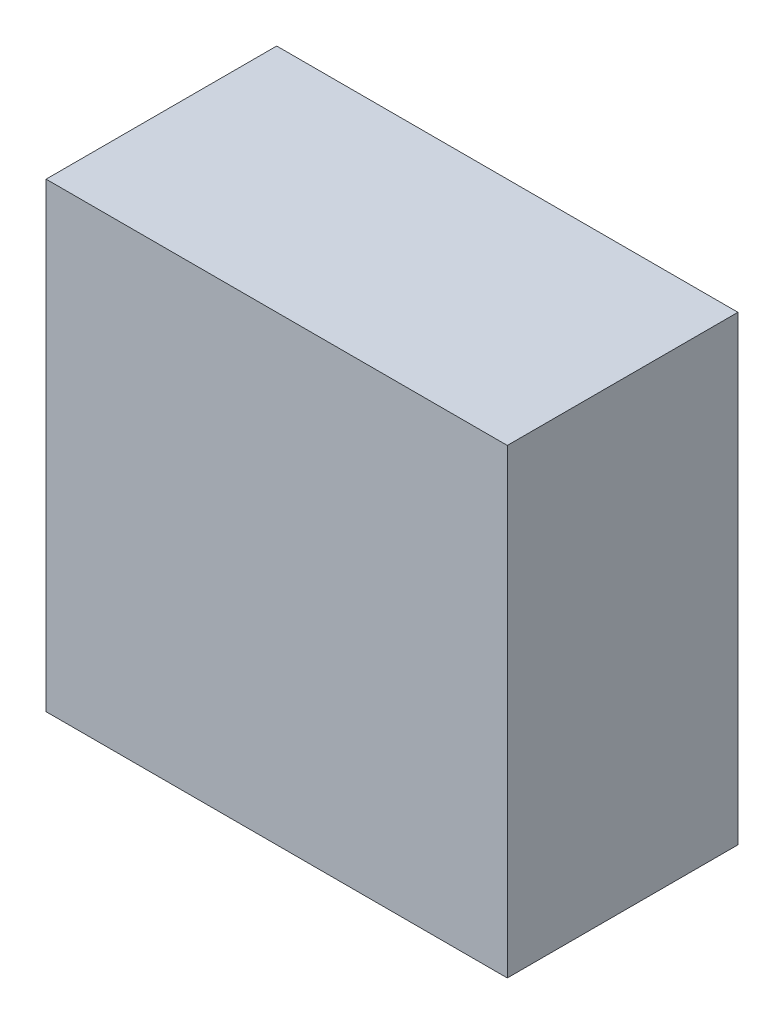
ISO-10303-21;
HEADER;
FILE_DESCRIPTION(('STEP AP214'),'2;1');
FILE_NAME('part.step','',(''),(''),'','','');
FILE_SCHEMA(('AUTOMOTIVE_DESIGN { 1 0 10303 214 1 1 1 1 }'));
ENDSEC;
DATA;
#1=APPLICATION_CONTEXT('core data for automotive mechanical design processes');
#2=APPLICATION_PROTOCOL_DEFINITION('international standard','automotive_design',2000,#1);
#3=PRODUCT_CONTEXT('',#1,'mechanical');
#4=PRODUCT('Part','Part','',(#3));
#5=PRODUCT_RELATED_PRODUCT_CATEGORY('part','',(#4));
#6=PRODUCT_DEFINITION_FORMATION('','',#4);
#7=PRODUCT_DEFINITION_CONTEXT('part definition',#1,'design');
#8=PRODUCT_DEFINITION('design','',#6,#7);
#9=PRODUCT_DEFINITION_SHAPE('','',#8);
#10=(LENGTH_UNIT() NAMED_UNIT(*) SI_UNIT(.MILLI.,.METRE.));
#11=(NAMED_UNIT(*) PLANE_ANGLE_UNIT() SI_UNIT($,.RADIAN.));
#12=(NAMED_UNIT(*) SI_UNIT($,.STERADIAN.) SOLID_ANGLE_UNIT());
#13=UNCERTAINTY_MEASURE_WITH_UNIT(LENGTH_MEASURE(1.E-05),#10,'distance_accuracy_value','');
#14=(GEOMETRIC_REPRESENTATION_CONTEXT(3) GLOBAL_UNCERTAINTY_ASSIGNED_CONTEXT((#13)) GLOBAL_UNIT_ASSIGNED_CONTEXT((#10,
#11,#12)) REPRESENTATION_CONTEXT('',''));
#15=CARTESIAN_POINT('',(0.,0.,0.));
#16=DIRECTION('',(0.,0.,1.));
#17=DIRECTION('',(1.,0.,0.));
#18=AXIS2_PLACEMENT_3D('',#15,#16,#17);
#19=CARTESIAN_POINT('',(0.,0.,2.75));
#20=DIRECTION('',(0.,0.,-1.));
#21=DIRECTION('',(-1.,0.,0.));
#22=AXIS2_PLACEMENT_3D('',#19,#20,#21);
#23=PLANE('',#22);
#24=DIRECTION('',(1.,0.,0.));
#25=VECTOR('',#24,1.);
#26=CARTESIAN_POINT('',(158.313158045851,-107.070884155696,2.75));
#27=LINE('',#26,#25);
#28=CARTESIAN_POINT('',(158.313158045851,-107.070884155696,2.75));
#29=VERTEX_POINT('',#28);
#30=CARTESIAN_POINT('',(154.313158045851,-107.070884155696,2.75));
#31=VERTEX_POINT('',#30);
#32=EDGE_CURVE('E80',#29,#31,#27,.F.);
#33=ORIENTED_EDGE('',*,*,#32,.T.);
#34=DIRECTION('',(0.,1.,0.));
#35=VECTOR('',#34,1.);
#36=CARTESIAN_POINT('',(154.313158045851,-107.070884155696,2.75));
#37=LINE('',#36,#35);
#38=CARTESIAN_POINT('',(154.313158045851,-111.070884155696,2.75));
#39=VERTEX_POINT('',#38);
#40=EDGE_CURVE('E55',#31,#39,#37,.F.);
#41=ORIENTED_EDGE('',*,*,#40,.T.);
#42=DIRECTION('',(1.,0.,0.));
#43=VECTOR('',#42,1.);
#44=CARTESIAN_POINT('',(158.313158045851,-111.070884155696,2.75));
#45=LINE('',#44,#43);
#46=CARTESIAN_POINT('',(158.313158045851,-111.070884155696,2.75));
#47=VERTEX_POINT('',#46);
#48=EDGE_CURVE('E57',#39,#47,#45,.T.);
#49=ORIENTED_EDGE('',*,*,#48,.T.);
#50=DIRECTION('',(0.,1.,0.));
#51=VECTOR('',#50,1.);
#52=CARTESIAN_POINT('',(158.313158045851,-107.070884155696,2.75));
#53=LINE('',#52,#51);
#54=EDGE_CURVE('E20',#47,#29,#53,.T.);
#55=ORIENTED_EDGE('',*,*,#54,.T.);
#56=EDGE_LOOP('',(#33,#41,#49,#55));
#57=FACE_BOUND('',#56,.T.);
#58=ADVANCED_FACE('F17',(#57),#23,.F.);
#59=CARTESIAN_POINT('',(158.313158045851,-107.070884155696,2.75));
#60=DIRECTION('',(-1.,0.,0.));
#61=DIRECTION('',(0.,0.,1.));
#62=AXIS2_PLACEMENT_3D('',#59,#60,#61);
#63=PLANE('',#62);
#64=DIRECTION('',(0.,0.,-1.));
#65=VECTOR('',#64,1.);
#66=CARTESIAN_POINT('',(158.313158045851,-107.070884155696,2.75));
#67=LINE('',#66,#65);
#68=CARTESIAN_POINT('',(158.313158045851,-107.070884155696,0.75));
#69=VERTEX_POINT('',#68);
#70=EDGE_CURVE('E68',#69,#29,#67,.F.);
#71=ORIENTED_EDGE('',*,*,#70,.T.);
#72=ORIENTED_EDGE('',*,*,#54,.F.);
#73=DIRECTION('',(0.,0.,1.));
#74=VECTOR('',#73,1.);
#75=CARTESIAN_POINT('',(158.313158045851,-111.070884155696,2.75));
#76=LINE('',#75,#74);
#77=CARTESIAN_POINT('',(158.313158045851,-111.070884155696,0.75));
#78=VERTEX_POINT('',#77);
#79=EDGE_CURVE('E63',#47,#78,#76,.F.);
#80=ORIENTED_EDGE('',*,*,#79,.T.);
#81=DIRECTION('',(0.,1.,0.));
#82=VECTOR('',#81,1.);
#83=CARTESIAN_POINT('',(158.313158045851,0.,0.75));
#84=LINE('',#83,#82);
#85=EDGE_CURVE('E83',#69,#78,#84,.F.);
#86=ORIENTED_EDGE('',*,*,#85,.F.);
#87=EDGE_LOOP('',(#71,#72,#80,#86));
#88=FACE_BOUND('',#87,.T.);
#89=ADVANCED_FACE('F65',(#88),#63,.F.);
#90=CARTESIAN_POINT('',(158.313158045851,-111.070884155696,2.75));
#91=DIRECTION('',(0.,1.,0.));
#92=DIRECTION('',(0.,0.,1.));
#93=AXIS2_PLACEMENT_3D('',#90,#91,#92);
#94=PLANE('',#93);
#95=ORIENTED_EDGE('',*,*,#79,.F.);
#96=ORIENTED_EDGE('',*,*,#48,.F.);
#97=DIRECTION('',(0.,0.,-1.));
#98=VECTOR('',#97,1.);
#99=CARTESIAN_POINT('',(154.313158045851,-111.070884155696,2.75));
#100=LINE('',#99,#98);
#101=CARTESIAN_POINT('',(154.313158045851,-111.070884155696,0.75));
#102=VERTEX_POINT('',#101);
#103=EDGE_CURVE('E75',#39,#102,#100,.T.);
#104=ORIENTED_EDGE('',*,*,#103,.T.);
#105=DIRECTION('',(-1.,0.,0.));
#106=VECTOR('',#105,1.);
#107=CARTESIAN_POINT('',(0.,-111.070884155696,0.75));
#108=LINE('',#107,#106);
#109=EDGE_CURVE('E72',#78,#102,#108,.T.);
#110=ORIENTED_EDGE('',*,*,#109,.F.);
#111=EDGE_LOOP('',(#95,#96,#104,#110));
#112=FACE_BOUND('',#111,.T.);
#113=ADVANCED_FACE('F70',(#112),#94,.F.);
#114=CARTESIAN_POINT('',(154.313158045851,-107.070884155696,2.75));
#115=DIRECTION('',(1.,0.,0.));
#116=DIRECTION('',(0.,0.,-1.));
#117=AXIS2_PLACEMENT_3D('',#114,#115,#116);
#118=PLANE('',#117);
#119=ORIENTED_EDGE('',*,*,#103,.F.);
#120=ORIENTED_EDGE('',*,*,#40,.F.);
#121=DIRECTION('',(0.,0.,-1.));
#122=VECTOR('',#121,1.);
#123=CARTESIAN_POINT('',(154.313158045851,-107.070884155696,2.75));
#124=LINE('',#123,#122);
#125=CARTESIAN_POINT('',(154.313158045851,-107.070884155696,0.75));
#126=VERTEX_POINT('',#125);
#127=EDGE_CURVE('E35',#31,#126,#124,.T.);
#128=ORIENTED_EDGE('',*,*,#127,.T.);
#129=DIRECTION('',(0.,1.,0.));
#130=VECTOR('',#129,1.);
#131=CARTESIAN_POINT('',(154.313158045851,0.,0.75));
#132=LINE('',#131,#130);
#133=EDGE_CURVE('E26',#102,#126,#132,.T.);
#134=ORIENTED_EDGE('',*,*,#133,.F.);
#135=EDGE_LOOP('',(#119,#120,#128,#134));
#136=FACE_BOUND('',#135,.T.);
#137=ADVANCED_FACE('F89',(#136),#118,.F.);
#138=CARTESIAN_POINT('',(158.313158045851,-107.070884155696,2.75));
#139=DIRECTION('',(0.,-1.,0.));
#140=DIRECTION('',(0.,0.,-1.));
#141=AXIS2_PLACEMENT_3D('',#138,#139,#140);
#142=PLANE('',#141);
#143=ORIENTED_EDGE('',*,*,#127,.F.);
#144=ORIENTED_EDGE('',*,*,#32,.F.);
#145=ORIENTED_EDGE('',*,*,#70,.F.);
#146=DIRECTION('',(-1.,0.,0.));
#147=VECTOR('',#146,1.);
#148=CARTESIAN_POINT('',(0.,-107.070884155696,0.75));
#149=LINE('',#148,#147);
#150=EDGE_CURVE('E11',#126,#69,#149,.F.);
#151=ORIENTED_EDGE('',*,*,#150,.F.);
#152=EDGE_LOOP('',(#143,#144,#145,#151));
#153=FACE_BOUND('',#152,.T.);
#154=ADVANCED_FACE('F91',(#153),#142,.F.);
#155=CARTESIAN_POINT('',(0.,0.,0.75));
#156=DIRECTION('',(0.,0.,-1.));
#157=DIRECTION('',(-1.,0.,0.));
#158=AXIS2_PLACEMENT_3D('',#155,#156,#157);
#159=PLANE('',#158);
#160=ORIENTED_EDGE('',*,*,#133,.T.);
#161=ORIENTED_EDGE('',*,*,#150,.T.);
#162=ORIENTED_EDGE('',*,*,#85,.T.);
#163=ORIENTED_EDGE('',*,*,#109,.T.);
#164=EDGE_LOOP('',(#160,#161,#162,#163));
#165=FACE_BOUND('',#164,.T.);
#166=ADVANCED_FACE('F88',(#165),#159,.T.);
#167=CLOSED_SHELL('',(#58,#89,#113,#137,#154,#166));
#168=MANIFOLD_SOLID_BREP('B1',#167);
#169=ADVANCED_BREP_SHAPE_REPRESENTATION('',(#18,#168),#14);
#170=SHAPE_DEFINITION_REPRESENTATION(#9,#169);
ENDSEC;
END-ISO-10303-21;
